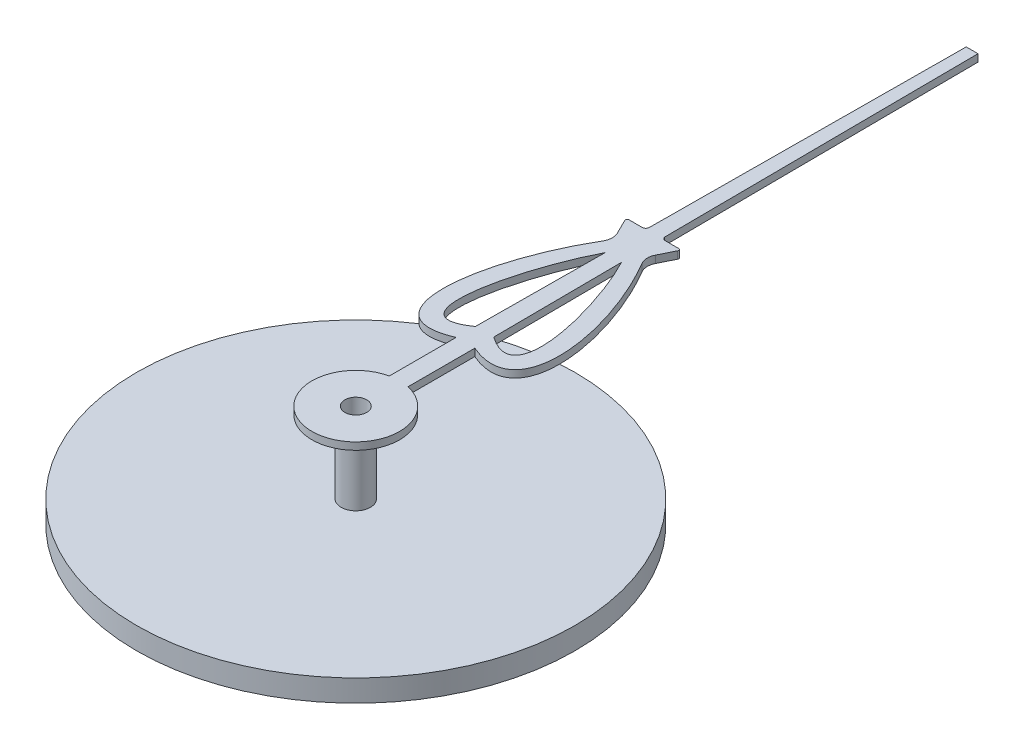
ISO-10303-21;
HEADER;
FILE_DESCRIPTION(('STEP AP214'),'2;1');
FILE_NAME('part.step','',(''),(''),'','','');
FILE_SCHEMA(('AUTOMOTIVE_DESIGN { 1 0 10303 214 1 1 1 1 }'));
ENDSEC;
DATA;
#1=APPLICATION_CONTEXT('core data for automotive mechanical design processes');
#2=APPLICATION_PROTOCOL_DEFINITION('international standard','automotive_design',2000,#1);
#3=PRODUCT_CONTEXT('',#1,'mechanical');
#4=PRODUCT('Part','Part','',(#3));
#5=PRODUCT_RELATED_PRODUCT_CATEGORY('part','',(#4));
#6=PRODUCT_DEFINITION_FORMATION('','',#4);
#7=PRODUCT_DEFINITION_CONTEXT('part definition',#1,'design');
#8=PRODUCT_DEFINITION('design','',#6,#7);
#9=PRODUCT_DEFINITION_SHAPE('','',#8);
#10=(LENGTH_UNIT() NAMED_UNIT(*) SI_UNIT(.MILLI.,.METRE.));
#11=(NAMED_UNIT(*) PLANE_ANGLE_UNIT() SI_UNIT($,.RADIAN.));
#12=(NAMED_UNIT(*) SI_UNIT($,.STERADIAN.) SOLID_ANGLE_UNIT());
#13=UNCERTAINTY_MEASURE_WITH_UNIT(LENGTH_MEASURE(1.E-05),#10,'distance_accuracy_value','');
#14=(GEOMETRIC_REPRESENTATION_CONTEXT(3) GLOBAL_UNCERTAINTY_ASSIGNED_CONTEXT((#13)) GLOBAL_UNIT_ASSIGNED_CONTEXT((#10,
#11,#12)) REPRESENTATION_CONTEXT('',''));
#15=CARTESIAN_POINT('',(0.,0.,0.));
#16=DIRECTION('',(0.,0.,1.));
#17=DIRECTION('',(1.,0.,0.));
#18=AXIS2_PLACEMENT_3D('',#15,#16,#17);
#19=CARTESIAN_POINT('',(-0.439252371956547,0.,-3.75029242968909));
#20=DIRECTION('',(0.,-1.,0.));
#21=DIRECTION('',(0.,0.,-1.));
#22=AXIS2_PLACEMENT_3D('',#19,#20,#21);
#23=PLANE('',#22);
#24=DIRECTION('',(0.00676100184731207,0.,0.999977144165816));
#25=VECTOR('',#24,1.);
#26=CARTESIAN_POINT('',(0.113918238942897,0.,-3.52247358415932));
#27=LINE('',#26,#25);
#28=CARTESIAN_POINT('',(0.113918238942897,0.,-3.52247358415932));
#29=VERTEX_POINT('',#28);
#30=CARTESIAN_POINT('',(0.125824318370261,0.,-1.76152046317765));
#31=VERTEX_POINT('',#30);
#32=EDGE_CURVE('E192',#29,#31,#27,.T.);
#33=ORIENTED_EDGE('',*,*,#32,.T.);
#34=CARTESIAN_POINT('',(0.125824318370261,0.,-1.76152046317765));
#35=CARTESIAN_POINT('',(0.890796604890787,0.,-1.23150101661974));
#36=CARTESIAN_POINT('',(0.501435582065783,0.,-2.78570546726484));
#37=CARTESIAN_POINT('',(0.113918238942897,0.,-3.52247358415932));
#38=B_SPLINE_CURVE_WITH_KNOTS('',3,(#34,#35,#36,#37),.UNSPECIFIED.,.F.,.F.,(4,4),
(0.0442298072719746,0.913901264469288),.UNSPECIFIED.);
#39=EDGE_CURVE('E55',#31,#29,#38,.T.);
#40=ORIENTED_EDGE('',*,*,#39,.T.);
#41=EDGE_LOOP('',(#33,#40));
#42=FACE_BOUND('',#41,.T.);
#43=CARTESIAN_POINT('',(-0.439252371956547,0.,-3.75029242968909));
#44=DIRECTION('',(0.,-1.,0.));
#45=DIRECTION('',(0.,0.,-1.));
#46=AXIS2_PLACEMENT_3D('',#43,#44,#45);
#47=CIRCLE('',#46,0.2);
#48=CARTESIAN_POINT('',(-0.260097073319557,0.,-3.83919338002311));
#49=VERTEX_POINT('',#48);
#50=CARTESIAN_POINT('',(-0.267201121331266,0.,-3.64832004539669));
#51=VERTEX_POINT('',#50);
#52=EDGE_CURVE('E250',#49,#51,#47,.T.);
#53=ORIENTED_EDGE('',*,*,#52,.F.);
#54=DIRECTION('',(0.444504751670083,0.,0.895776493184945));
#55=VECTOR('',#54,1.);
#56=CARTESIAN_POINT('',(-0.359543257675398,0.,-4.03959968377623));
#57=LINE('',#56,#55);
#58=CARTESIAN_POINT('',(-0.359543257675398,0.,-4.03959968377623));
#59=VERTEX_POINT('',#58);
#60=EDGE_CURVE('E255',#59,#49,#57,.T.);
#61=ORIENTED_EDGE('',*,*,#60,.F.);
#62=CARTESIAN_POINT('',(-0.341513018869607,0.,-4.05430167591648));
#63=DIRECTION('',(0.,1.,0.));
#64=DIRECTION('',(0.,0.,1.));
#65=AXIS2_PLACEMENT_3D('',#62,#63,#64);
#66=CIRCLE('',#65,0.0232645241577366);
#67=CARTESIAN_POINT('',(-0.338780115051659,0.,-4.07740512416577));
#68=VERTEX_POINT('',#67);
#69=EDGE_CURVE('E365',#68,#59,#66,.T.);
#70=ORIENTED_EDGE('',*,*,#69,.F.);
#71=DIRECTION('',(-1.,0.,0.));
#72=VECTOR('',#71,1.);
#73=CARTESIAN_POINT('',(-0.338780115051659,0.,-4.07740512416577));
#74=LINE('',#73,#72);
#75=CARTESIAN_POINT('',(-0.15739830831444,0.,-4.07740512416578));
#76=VERTEX_POINT('',#75);
#77=EDGE_CURVE('E363',#76,#68,#74,.T.);
#78=ORIENTED_EDGE('',*,*,#77,.F.);
#79=CARTESIAN_POINT('',(-0.157920702518011,0.,-4.1265883765196));
#80=DIRECTION('',(0.,-1.,0.));
#81=DIRECTION('',(0.,0.,1.));
#82=AXIS2_PLACEMENT_3D('',#79,#80,#81);
#83=CIRCLE('',#82,0.0491860265502689);
#84=CARTESIAN_POINT('',(-0.108734748762399,0.,-4.12667299894273));
#85=VERTEX_POINT('',#84);
#86=EDGE_CURVE('E361',#85,#76,#83,.T.);
#87=ORIENTED_EDGE('',*,*,#86,.F.);
#88=DIRECTION('',(-0.00654590531321647,0.,0.999978575332307));
#89=VECTOR('',#88,1.);
#90=CARTESIAN_POINT('',(-0.108734748762399,0.,-4.12667299894273));
#91=LINE('',#90,#89);
#92=CARTESIAN_POINT('',(-0.0805415314806858,0.,-8.43358119611438));
#93=VERTEX_POINT('',#92);
#94=EDGE_CURVE('E359',#93,#85,#91,.T.);
#95=ORIENTED_EDGE('',*,*,#94,.F.);
#96=DIRECTION('',(-1.,0.,0.));
#97=VECTOR('',#96,1.);
#98=CARTESIAN_POINT('',(-0.0805415314806858,0.,-8.43358119611438));
#99=LINE('',#98,#97);
#100=CARTESIAN_POINT('',(0.0806992721334232,0.,-8.43358119611438));
#101=VERTEX_POINT('',#100);
#102=EDGE_CURVE('E357',#101,#93,#99,.T.);
#103=ORIENTED_EDGE('',*,*,#102,.F.);
#104=DIRECTION('',(-0.00676429048693853,0.,-0.999977121925401));
#105=VECTOR('',#104,1.);
#106=CARTESIAN_POINT('',(0.109905863169236,0.,-4.11591877436605));
#107=LINE('',#106,#105);
#108=CARTESIAN_POINT('',(0.109905863169236,0.,-4.11591877436605));
#109=VERTEX_POINT('',#108);
#110=EDGE_CURVE('E355',#109,#101,#107,.T.);
#111=ORIENTED_EDGE('',*,*,#110,.F.);
#112=CARTESIAN_POINT('',(0.157920702518011,0.,-4.1265883765196));
#113=DIRECTION('',(0.,-1.,0.));
#114=DIRECTION('',(0.,0.,-1.));
#115=AXIS2_PLACEMENT_3D('',#112,#113,#114);
#116=CIRCLE('',#115,0.0491860265502685);
#117=CARTESIAN_POINT('',(0.15739830831444,0.,-4.07740512416578));
#118=VERTEX_POINT('',#117);
#119=EDGE_CURVE('E353',#118,#109,#116,.T.);
#120=ORIENTED_EDGE('',*,*,#119,.F.);
#121=DIRECTION('',(-1.,0.,0.));
#122=VECTOR('',#121,1.);
#123=CARTESIAN_POINT('',(0.338780115051659,0.,-4.07740512416577));
#124=LINE('',#123,#122);
#125=CARTESIAN_POINT('',(0.338780115051659,0.,-4.07740512416577));
#126=VERTEX_POINT('',#125);
#127=EDGE_CURVE('E351',#126,#118,#124,.T.);
#128=ORIENTED_EDGE('',*,*,#127,.F.);
#129=CARTESIAN_POINT('',(0.341513018869607,0.,-4.05430167591648));
#130=DIRECTION('',(0.,1.,0.));
#131=DIRECTION('',(0.,0.,-1.));
#132=AXIS2_PLACEMENT_3D('',#129,#130,#131);
#133=CIRCLE('',#132,0.0232645241577355);
#134=CARTESIAN_POINT('',(0.359543257675399,0.,-4.03959968377623));
#135=VERTEX_POINT('',#134);
#136=EDGE_CURVE('E349',#135,#126,#133,.T.);
#137=ORIENTED_EDGE('',*,*,#136,.F.);
#138=DIRECTION('',(0.444504751670083,0.,-0.895776493184945));
#139=VECTOR('',#138,1.);
#140=CARTESIAN_POINT('',(0.359543257675398,0.,-4.03959968377623));
#141=LINE('',#140,#139);
#142=CARTESIAN_POINT('',(0.260097073319557,0.,-3.83919338002311));
#143=VERTEX_POINT('',#142);
#144=EDGE_CURVE('E347',#143,#135,#141,.T.);
#145=ORIENTED_EDGE('',*,*,#144,.F.);
#146=CARTESIAN_POINT('',(0.439252371956547,0.,-3.7502924296891));
#147=DIRECTION('',(0.,-1.,0.));
#148=DIRECTION('',(0.,0.,1.));
#149=AXIS2_PLACEMENT_3D('',#146,#147,#148);
#150=CIRCLE('',#149,0.2);
#151=CARTESIAN_POINT('',(0.267201121331266,0.,-3.6483200453967));
#152=VERTEX_POINT('',#151);
#153=EDGE_CURVE('E342',#152,#143,#150,.T.);
#154=ORIENTED_EDGE('',*,*,#153,.F.);
#155=CARTESIAN_POINT('',(0.127585762607159,0.,-1.50099635485761));
#156=CARTESIAN_POINT('',(1.09963417027628,0.,-1.08449408649671));
#157=CARTESIAN_POINT('',(0.895222739099174,0.,-2.58870076213929));
#158=CARTESIAN_POINT('',(0.267201121331267,0.,-3.64832004539669));
#159=B_SPLINE_CURVE_WITH_KNOTS('',3,(#155,#156,#157,#158),.UNSPECIFIED.,.F.,.F.,(4,4),(0.,
0.927047388848107),.UNSPECIFIED.);
#160=CARTESIAN_POINT('',(0.127585762607159,0.,-1.50099635485761));
#161=VERTEX_POINT('',#160);
#162=EDGE_CURVE('E338',#161,#152,#159,.T.);
#163=ORIENTED_EDGE('',*,*,#162,.F.);
#164=DIRECTION('',(0.,0.,-1.));
#165=VECTOR('',#164,1.);
#166=CARTESIAN_POINT('',(0.127585762607159,0.,-0.586277982854507));
#167=LINE('',#166,#165);
#168=CARTESIAN_POINT('',(0.127585762607159,0.,-0.586277982854507));
#169=VERTEX_POINT('',#168);
#170=EDGE_CURVE('E336',#169,#161,#167,.T.);
#171=ORIENTED_EDGE('',*,*,#170,.F.);
#172=CARTESIAN_POINT('',(0.,0.,0.));
#173=DIRECTION('',(0.,1.,0.));
#174=DIRECTION('',(0.,0.,1.));
#175=AXIS2_PLACEMENT_3D('',#172,#173,#174);
#176=CIRCLE('',#175,0.6);
#177=CARTESIAN_POINT('',(-0.127585762607159,0.,-0.586277982854507));
#178=VERTEX_POINT('',#177);
#179=EDGE_CURVE('E334',#178,#169,#176,.T.);
#180=ORIENTED_EDGE('',*,*,#179,.F.);
#181=DIRECTION('',(0.,0.,1.));
#182=VECTOR('',#181,1.);
#183=CARTESIAN_POINT('',(-0.127585762607159,0.,-0.586277982854507));
#184=LINE('',#183,#182);
#185=CARTESIAN_POINT('',(-0.127585762607159,0.,-1.50099635485761));
#186=VERTEX_POINT('',#185);
#187=EDGE_CURVE('E329',#186,#178,#184,.T.);
#188=ORIENTED_EDGE('',*,*,#187,.F.);
#189=CARTESIAN_POINT('',(-0.267201121331266,0.,-3.64832004539669));
#190=CARTESIAN_POINT('',(-0.581211930214034,0.,-3.11851040376647));
#191=CARTESIAN_POINT('',(-0.9974284546826,0.,-1.83659742433071));
#192=CARTESIAN_POINT('',(-0.613609966442191,0.,-1.29274522067696));
#193=CARTESIAN_POINT('',(-0.127585762607159,0.,-1.50099635485761));
#194=B_SPLINE_CURVE_WITH_KNOTS('',3,(#189,#190,#191,#192,#193),.UNSPECIFIED.,.F.,.F.,(4,1,4),
(0.,0.463523694424504,0.927047388849008),.UNSPECIFIED.);
#195=EDGE_CURVE('E325',#51,#186,#194,.T.);
#196=ORIENTED_EDGE('',*,*,#195,.F.);
#197=EDGE_LOOP('',(#53,#61,#70,#78,#87,#95,#103,#111,#120,#128,#137,#145,#154,#163,#171,#180,
#188,#196));
#198=FACE_BOUND('',#197,.T.);
#199=DIRECTION('',(0.00717930293046789,0.,-0.999974228472631));
#200=VECTOR('',#199,1.);
#201=CARTESIAN_POINT('',(-0.113060898003382,0.,-3.52410227704847));
#202=LINE('',#201,#200);
#203=CARTESIAN_POINT('',(-0.125714787999534,0.,-1.76159636127489));
#204=VERTEX_POINT('',#203);
#205=CARTESIAN_POINT('',(-0.113060898003382,0.,-3.52410227704847));
#206=VERTEX_POINT('',#205);
#207=EDGE_CURVE('E229',#204,#206,#202,.T.);
#208=ORIENTED_EDGE('',*,*,#207,.T.);
#209=CARTESIAN_POINT('',(-0.113060898003382,0.,-3.52410227704847));
#210=CARTESIAN_POINT('',(-0.500879165719079,0.,-2.78796384765671));
#211=CARTESIAN_POINT('',(-0.891397992087325,0.,-1.23096165036123));
#212=CARTESIAN_POINT('',(-0.125714787999534,0.,-1.76159636127489));
#213=B_SPLINE_CURVE_WITH_KNOTS('',3,(#209,#210,#211,#212),.UNSPECIFIED.,.F.,.F.,(4,4),
(0.0441883031194786,0.914542618958986),.UNSPECIFIED.);
#214=EDGE_CURVE('E235',#206,#204,#213,.T.);
#215=ORIENTED_EDGE('',*,*,#214,.T.);
#216=EDGE_LOOP('',(#208,#215));
#217=FACE_BOUND('',#216,.T.);
#218=CARTESIAN_POINT('',(0.,0.,0.));
#219=DIRECTION('',(0.,-1.,0.));
#220=DIRECTION('',(0.,0.,-1.));
#221=AXIS2_PLACEMENT_3D('',#218,#219,#220);
#222=CIRCLE('',#221,0.2);
#223=CARTESIAN_POINT('',(0.,0.,-0.2));
#224=VERTEX_POINT('',#223);
#225=EDGE_CURVE('E199',#224,#224,#222,.T.);
#226=ORIENTED_EDGE('',*,*,#225,.F.);
#227=EDGE_LOOP('',(#226));
#228=FACE_BOUND('',#227,.T.);
#229=ADVANCED_FACE('F33',(#42,#198,#217,#228),#23,.T.);
#230=CARTESIAN_POINT('',(-0.439252371956547,0.1,-3.75029242968909));
#231=DIRECTION('',(0.,-1.,0.));
#232=DIRECTION('',(0.,0.,-1.));
#233=AXIS2_PLACEMENT_3D('',#230,#231,#232);
#234=PLANE('',#233);
#235=CARTESIAN_POINT('',(0.,0.1,0.));
#236=DIRECTION('',(0.,1.,0.));
#237=DIRECTION('',(0.,0.,1.));
#238=AXIS2_PLACEMENT_3D('',#235,#236,#237);
#239=CIRCLE('',#238,0.15);
#240=CARTESIAN_POINT('',(0.,0.1,0.15));
#241=VERTEX_POINT('',#240);
#242=EDGE_CURVE('E721',#241,#241,#239,.T.);
#243=ORIENTED_EDGE('',*,*,#242,.F.);
#244=EDGE_LOOP('',(#243));
#245=FACE_BOUND('',#244,.T.);
#246=CARTESIAN_POINT('',(-0.113060898003382,0.1,-3.52410227704847));
#247=CARTESIAN_POINT('',(-0.500879165719079,0.1,-2.78796384765671));
#248=CARTESIAN_POINT('',(-0.891397992087325,0.1,-1.23096165036123));
#249=CARTESIAN_POINT('',(-0.125714787999534,0.1,-1.76159636127489));
#250=B_SPLINE_CURVE_WITH_KNOTS('',3,(#246,#247,#248,#249),.UNSPECIFIED.,.F.,.F.,(4,4),
(0.0441883031194786,0.914542618958986),.UNSPECIFIED.);
#251=CARTESIAN_POINT('',(-0.113060898003382,0.1,-3.52410227704847));
#252=VERTEX_POINT('',#251);
#253=CARTESIAN_POINT('',(-0.125714787999534,0.1,-1.76159636127489));
#254=VERTEX_POINT('',#253);
#255=EDGE_CURVE('E221',#252,#254,#250,.T.);
#256=ORIENTED_EDGE('',*,*,#255,.F.);
#257=DIRECTION('',(0.00717930293046789,0.,-0.999974228472631));
#258=VECTOR('',#257,1.);
#259=CARTESIAN_POINT('',(-0.113060898003382,0.1,-3.52410227704847));
#260=LINE('',#259,#258);
#261=EDGE_CURVE('E228',#254,#252,#260,.T.);
#262=ORIENTED_EDGE('',*,*,#261,.F.);
#263=EDGE_LOOP('',(#256,#262));
#264=FACE_BOUND('',#263,.T.);
#265=CARTESIAN_POINT('',(-0.439252371956547,0.1,-3.75029242968909));
#266=DIRECTION('',(0.,-1.,0.));
#267=DIRECTION('',(0.,0.,-1.));
#268=AXIS2_PLACEMENT_3D('',#265,#266,#267);
#269=CIRCLE('',#268,0.2);
#270=CARTESIAN_POINT('',(-0.260097073319557,0.1,-3.83919338002311));
#271=VERTEX_POINT('',#270);
#272=CARTESIAN_POINT('',(-0.267201121331266,0.1,-3.64832004539669));
#273=VERTEX_POINT('',#272);
#274=EDGE_CURVE('E251',#271,#273,#269,.T.);
#275=ORIENTED_EDGE('',*,*,#274,.T.);
#276=CARTESIAN_POINT('',(-0.267201121331266,0.1,-3.64832004539669));
#277=CARTESIAN_POINT('',(-0.581211930214034,0.1,-3.11851040376647));
#278=CARTESIAN_POINT('',(-0.9974284546826,0.1,-1.83659742433071));
#279=CARTESIAN_POINT('',(-0.613609966442191,0.1,-1.29274522067696));
#280=CARTESIAN_POINT('',(-0.127585762607159,0.1,-1.50099635485761));
#281=B_SPLINE_CURVE_WITH_KNOTS('',3,(#276,#277,#278,#279,#280),.UNSPECIFIED.,.F.,.F.,(4,1,4),
(0.,0.463523694424504,0.927047388849008),.UNSPECIFIED.);
#282=CARTESIAN_POINT('',(-0.127585762607159,0.1,-1.50099635485761));
#283=VERTEX_POINT('',#282);
#284=EDGE_CURVE('E254',#273,#283,#281,.T.);
#285=ORIENTED_EDGE('',*,*,#284,.T.);
#286=DIRECTION('',(0.,0.,1.));
#287=VECTOR('',#286,1.);
#288=CARTESIAN_POINT('',(-0.127585762607159,0.1,-0.586277982854507));
#289=LINE('',#288,#287);
#290=CARTESIAN_POINT('',(-0.127585762607159,0.1,-0.586277982854507));
#291=VERTEX_POINT('',#290);
#292=EDGE_CURVE('E260',#283,#291,#289,.T.);
#293=ORIENTED_EDGE('',*,*,#292,.T.);
#294=CARTESIAN_POINT('',(0.,0.1,0.));
#295=DIRECTION('',(0.,1.,0.));
#296=DIRECTION('',(0.,0.,1.));
#297=AXIS2_PLACEMENT_3D('',#294,#295,#296);
#298=CIRCLE('',#297,0.6);
#299=CARTESIAN_POINT('',(0.127585762607159,0.1,-0.586277982854507));
#300=VERTEX_POINT('',#299);
#301=EDGE_CURVE('E431',#291,#300,#298,.T.);
#302=ORIENTED_EDGE('',*,*,#301,.T.);
#303=DIRECTION('',(0.,0.,-1.));
#304=VECTOR('',#303,1.);
#305=CARTESIAN_POINT('',(0.127585762607159,0.1,-0.586277982854507));
#306=LINE('',#305,#304);
#307=CARTESIAN_POINT('',(0.127585762607159,0.1,-1.50099635485761));
#308=VERTEX_POINT('',#307);
#309=EDGE_CURVE('E295',#300,#308,#306,.T.);
#310=ORIENTED_EDGE('',*,*,#309,.T.);
#311=CARTESIAN_POINT('',(0.127585762607159,0.1,-1.50099635485761));
#312=CARTESIAN_POINT('',(1.09963417027628,0.1,-1.08449408649671));
#313=CARTESIAN_POINT('',(0.895222739099174,0.1,-2.58870076213929));
#314=CARTESIAN_POINT('',(0.267201121331267,0.1,-3.64832004539669));
#315=B_SPLINE_CURVE_WITH_KNOTS('',3,(#311,#312,#313,#314),.UNSPECIFIED.,.F.,.F.,(4,4),(0.,
0.927047388848107),.UNSPECIFIED.);
#316=CARTESIAN_POINT('',(0.267201121331266,0.1,-3.6483200453967));
#317=VERTEX_POINT('',#316);
#318=EDGE_CURVE('E288',#308,#317,#315,.T.);
#319=ORIENTED_EDGE('',*,*,#318,.T.);
#320=CARTESIAN_POINT('',(0.439252371956547,0.1,-3.7502924296891));
#321=DIRECTION('',(0.,-1.,0.));
#322=DIRECTION('',(0.,0.,1.));
#323=AXIS2_PLACEMENT_3D('',#320,#321,#322);
#324=CIRCLE('',#323,0.2);
#325=CARTESIAN_POINT('',(0.260097073319557,0.1,-3.83919338002311));
#326=VERTEX_POINT('',#325);
#327=EDGE_CURVE('E294',#317,#326,#324,.T.);
#328=ORIENTED_EDGE('',*,*,#327,.T.);
#329=DIRECTION('',(0.444504751670083,0.,-0.895776493184945));
#330=VECTOR('',#329,1.);
#331=CARTESIAN_POINT('',(0.359543257675398,0.1,-4.03959968377623));
#332=LINE('',#331,#330);
#333=CARTESIAN_POINT('',(0.359543257675399,0.1,-4.03959968377623));
#334=VERTEX_POINT('',#333);
#335=EDGE_CURVE('E300',#326,#334,#332,.T.);
#336=ORIENTED_EDGE('',*,*,#335,.T.);
#337=CARTESIAN_POINT('',(0.341513018869607,0.1,-4.05430167591648));
#338=DIRECTION('',(0.,1.,0.));
#339=DIRECTION('',(0.,0.,-1.));
#340=AXIS2_PLACEMENT_3D('',#337,#338,#339);
#341=CIRCLE('',#340,0.0232645241577355);
#342=CARTESIAN_POINT('',(0.338780115051659,0.1,-4.07740512416577));
#343=VERTEX_POINT('',#342);
#344=EDGE_CURVE('E302',#334,#343,#341,.T.);
#345=ORIENTED_EDGE('',*,*,#344,.T.);
#346=DIRECTION('',(-1.,0.,0.));
#347=VECTOR('',#346,1.);
#348=CARTESIAN_POINT('',(0.338780115051659,0.1,-4.07740512416577));
#349=LINE('',#348,#347);
#350=CARTESIAN_POINT('',(0.15739830831444,0.1,-4.07740512416578));
#351=VERTEX_POINT('',#350);
#352=EDGE_CURVE('E304',#343,#351,#349,.T.);
#353=ORIENTED_EDGE('',*,*,#352,.T.);
#354=CARTESIAN_POINT('',(0.157920702518011,0.1,-4.1265883765196));
#355=DIRECTION('',(0.,-1.,0.));
#356=DIRECTION('',(0.,0.,-1.));
#357=AXIS2_PLACEMENT_3D('',#354,#355,#356);
#358=CIRCLE('',#357,0.0491860265502685);
#359=CARTESIAN_POINT('',(0.109905863169236,0.1,-4.11591877436605));
#360=VERTEX_POINT('',#359);
#361=EDGE_CURVE('E306',#351,#360,#358,.T.);
#362=ORIENTED_EDGE('',*,*,#361,.T.);
#363=DIRECTION('',(-0.00676429048693853,0.,-0.999977121925401));
#364=VECTOR('',#363,1.);
#365=CARTESIAN_POINT('',(0.109905863169236,0.1,-4.11591877436605));
#366=LINE('',#365,#364);
#367=CARTESIAN_POINT('',(0.0806992721334232,0.1,-8.43358119611438));
#368=VERTEX_POINT('',#367);
#369=EDGE_CURVE('E308',#360,#368,#366,.T.);
#370=ORIENTED_EDGE('',*,*,#369,.T.);
#371=DIRECTION('',(-1.,0.,0.));
#372=VECTOR('',#371,1.);
#373=CARTESIAN_POINT('',(-0.0805415314806858,0.1,-8.43358119611438));
#374=LINE('',#373,#372);
#375=CARTESIAN_POINT('',(-0.0805415314806858,0.1,-8.43358119611438));
#376=VERTEX_POINT('',#375);
#377=EDGE_CURVE('E310',#368,#376,#374,.T.);
#378=ORIENTED_EDGE('',*,*,#377,.T.);
#379=DIRECTION('',(-0.00654590531321647,0.,0.999978575332307));
#380=VECTOR('',#379,1.);
#381=CARTESIAN_POINT('',(-0.108734748762399,0.1,-4.12667299894273));
#382=LINE('',#381,#380);
#383=CARTESIAN_POINT('',(-0.108734748762399,0.1,-4.12667299894273));
#384=VERTEX_POINT('',#383);
#385=EDGE_CURVE('E312',#376,#384,#382,.T.);
#386=ORIENTED_EDGE('',*,*,#385,.T.);
#387=CARTESIAN_POINT('',(-0.157920702518011,0.1,-4.1265883765196));
#388=DIRECTION('',(0.,-1.,0.));
#389=DIRECTION('',(0.,0.,1.));
#390=AXIS2_PLACEMENT_3D('',#387,#388,#389);
#391=CIRCLE('',#390,0.0491860265502689);
#392=CARTESIAN_POINT('',(-0.15739830831444,0.1,-4.07740512416578));
#393=VERTEX_POINT('',#392);
#394=EDGE_CURVE('E314',#384,#393,#391,.T.);
#395=ORIENTED_EDGE('',*,*,#394,.T.);
#396=DIRECTION('',(-1.,0.,0.));
#397=VECTOR('',#396,1.);
#398=CARTESIAN_POINT('',(-0.338780115051659,0.1,-4.07740512416577));
#399=LINE('',#398,#397);
#400=CARTESIAN_POINT('',(-0.338780115051659,0.1,-4.07740512416577));
#401=VERTEX_POINT('',#400);
#402=EDGE_CURVE('E316',#393,#401,#399,.T.);
#403=ORIENTED_EDGE('',*,*,#402,.T.);
#404=CARTESIAN_POINT('',(-0.341513018869607,0.1,-4.05430167591648));
#405=DIRECTION('',(0.,1.,0.));
#406=DIRECTION('',(0.,0.,1.));
#407=AXIS2_PLACEMENT_3D('',#404,#405,#406);
#408=CIRCLE('',#407,0.0232645241577366);
#409=CARTESIAN_POINT('',(-0.359543257675398,0.1,-4.03959968377623));
#410=VERTEX_POINT('',#409);
#411=EDGE_CURVE('E318',#401,#410,#408,.T.);
#412=ORIENTED_EDGE('',*,*,#411,.T.);
#413=DIRECTION('',(0.444504751670083,0.,0.895776493184945));
#414=VECTOR('',#413,1.);
#415=CARTESIAN_POINT('',(-0.359543257675398,0.1,-4.03959968377623));
#416=LINE('',#415,#414);
#417=EDGE_CURVE('E320',#410,#271,#416,.T.);
#418=ORIENTED_EDGE('',*,*,#417,.T.);
#419=EDGE_LOOP('',(#275,#285,#293,#302,#310,#319,#328,#336,#345,#353,#362,#370,#378,#386,#395,
#403,#412,#418));
#420=FACE_BOUND('',#419,.T.);
#421=CARTESIAN_POINT('',(0.125824318370261,0.1,-1.76152046317765));
#422=CARTESIAN_POINT('',(0.890796604890787,0.1,-1.23150101661974));
#423=CARTESIAN_POINT('',(0.501435582065783,0.1,-2.78570546726484));
#424=CARTESIAN_POINT('',(0.113918238942897,0.1,-3.52247358415932));
#425=B_SPLINE_CURVE_WITH_KNOTS('',3,(#421,#422,#423,#424),.UNSPECIFIED.,.F.,.F.,(4,4),
(0.0442298072719746,0.913901264469288),.UNSPECIFIED.);
#426=CARTESIAN_POINT('',(0.125824318370261,0.1,-1.76152046317765));
#427=VERTEX_POINT('',#426);
#428=CARTESIAN_POINT('',(0.113918238942897,0.1,-3.52247358415932));
#429=VERTEX_POINT('',#428);
#430=EDGE_CURVE('E187',#427,#429,#425,.T.);
#431=ORIENTED_EDGE('',*,*,#430,.F.);
#432=DIRECTION('',(0.00676100184731207,0.,0.999977144165816));
#433=VECTOR('',#432,1.);
#434=CARTESIAN_POINT('',(0.113918238942897,0.1,-3.52247358415932));
#435=LINE('',#434,#433);
#436=EDGE_CURVE('E181',#429,#427,#435,.T.);
#437=ORIENTED_EDGE('',*,*,#436,.F.);
#438=EDGE_LOOP('',(#431,#437));
#439=FACE_BOUND('',#438,.T.);
#440=ADVANCED_FACE('F191',(#245,#264,#420,#439),#234,.F.);
#441=CARTESIAN_POINT('',(-0.439252371956547,0.1,-3.75029242968909));
#442=DIRECTION('',(0.,-1.,0.));
#443=DIRECTION('',(0.,0.,-1.));
#444=AXIS2_PLACEMENT_3D('',#441,#442,#443);
#445=CYLINDRICAL_SURFACE('',#444,0.2);
#446=ORIENTED_EDGE('',*,*,#52,.T.);
#447=DIRECTION('',(0.,-1.,0.));
#448=VECTOR('',#447,1.);
#449=CARTESIAN_POINT('',(-0.267201121331266,0.1,-3.64832004539669));
#450=LINE('',#449,#448);
#451=EDGE_CURVE('E11',#273,#51,#450,.T.);
#452=ORIENTED_EDGE('',*,*,#451,.F.);
#453=ORIENTED_EDGE('',*,*,#274,.F.);
#454=DIRECTION('',(0.,-1.,0.));
#455=VECTOR('',#454,1.);
#456=CARTESIAN_POINT('',(-0.260097073319557,0.1,-3.83919338002311));
#457=LINE('',#456,#455);
#458=EDGE_CURVE('E322',#271,#49,#457,.T.);
#459=ORIENTED_EDGE('',*,*,#458,.T.);
#460=EDGE_LOOP('',(#446,#452,#453,#459));
#461=FACE_BOUND('',#460,.T.);
#462=ADVANCED_FACE('F35',(#461),#445,.F.);
#463=DIRECTION('',(0.,-1.,0.));
#464=VECTOR('',#463,1.);
#465=SURFACE_OF_LINEAR_EXTRUSION('',#281,#464);
#466=ORIENTED_EDGE('',*,*,#195,.T.);
#467=DIRECTION('',(0.,-1.,0.));
#468=VECTOR('',#467,1.);
#469=CARTESIAN_POINT('',(-0.127585762607159,0.1,-1.50099635485761));
#470=LINE('',#469,#468);
#471=EDGE_CURVE('E41',#283,#186,#470,.T.);
#472=ORIENTED_EDGE('',*,*,#471,.F.);
#473=ORIENTED_EDGE('',*,*,#284,.F.);
#474=ORIENTED_EDGE('',*,*,#451,.T.);
#475=EDGE_LOOP('',(#466,#472,#473,#474));
#476=FACE_BOUND('',#475,.T.);
#477=ADVANCED_FACE('F265',(#476),#465,.F.);
#478=CARTESIAN_POINT('',(-0.127585762607159,0.1,-0.586277982854507));
#479=DIRECTION('',(1.,0.,0.));
#480=DIRECTION('',(0.,0.,-1.));
#481=AXIS2_PLACEMENT_3D('',#478,#479,#480);
#482=PLANE('',#481);
#483=ORIENTED_EDGE('',*,*,#187,.T.);
#484=DIRECTION('',(0.,-1.,0.));
#485=VECTOR('',#484,1.);
#486=CARTESIAN_POINT('',(-0.127585762607159,0.1,-0.586277982854507));
#487=LINE('',#486,#485);
#488=EDGE_CURVE('E412',#291,#178,#487,.T.);
#489=ORIENTED_EDGE('',*,*,#488,.F.);
#490=ORIENTED_EDGE('',*,*,#292,.F.);
#491=ORIENTED_EDGE('',*,*,#471,.T.);
#492=EDGE_LOOP('',(#483,#489,#490,#491));
#493=FACE_BOUND('',#492,.T.);
#494=ADVANCED_FACE('F268',(#493),#482,.F.);
#495=CARTESIAN_POINT('',(0.,0.1,0.));
#496=DIRECTION('',(0.,-1.,0.));
#497=DIRECTION('',(0.,0.,-1.));
#498=AXIS2_PLACEMENT_3D('',#495,#496,#497);
#499=CYLINDRICAL_SURFACE('',#498,0.6);
#500=ORIENTED_EDGE('',*,*,#179,.T.);
#501=DIRECTION('',(0.,-1.,0.));
#502=VECTOR('',#501,1.);
#503=CARTESIAN_POINT('',(0.127585762607159,0.1,-0.586277982854507));
#504=LINE('',#503,#502);
#505=EDGE_CURVE('E409',#300,#169,#504,.T.);
#506=ORIENTED_EDGE('',*,*,#505,.F.);
#507=ORIENTED_EDGE('',*,*,#301,.F.);
#508=ORIENTED_EDGE('',*,*,#488,.T.);
#509=EDGE_LOOP('',(#500,#506,#507,#508));
#510=FACE_BOUND('',#509,.T.);
#511=ADVANCED_FACE('F272',(#510),#499,.T.);
#512=CARTESIAN_POINT('',(0.127585762607159,0.1,-0.586277982854507));
#513=DIRECTION('',(-1.,0.,0.));
#514=DIRECTION('',(0.,0.,1.));
#515=AXIS2_PLACEMENT_3D('',#512,#513,#514);
#516=PLANE('',#515);
#517=ORIENTED_EDGE('',*,*,#170,.T.);
#518=DIRECTION('',(0.,-1.,0.));
#519=VECTOR('',#518,1.);
#520=CARTESIAN_POINT('',(0.127585762607159,0.1,-1.50099635485761));
#521=LINE('',#520,#519);
#522=EDGE_CURVE('E406',#308,#161,#521,.T.);
#523=ORIENTED_EDGE('',*,*,#522,.F.);
#524=ORIENTED_EDGE('',*,*,#309,.F.);
#525=ORIENTED_EDGE('',*,*,#505,.T.);
#526=EDGE_LOOP('',(#517,#523,#524,#525));
#527=FACE_BOUND('',#526,.T.);
#528=ADVANCED_FACE('F276',(#527),#516,.F.);
#529=DIRECTION('',(0.,-1.,0.));
#530=VECTOR('',#529,1.);
#531=SURFACE_OF_LINEAR_EXTRUSION('',#315,#530);
#532=ORIENTED_EDGE('',*,*,#162,.T.);
#533=DIRECTION('',(0.,-1.,0.));
#534=VECTOR('',#533,1.);
#535=CARTESIAN_POINT('',(0.267201121331266,0.1,-3.6483200453967));
#536=LINE('',#535,#534);
#537=EDGE_CURVE('E403',#317,#152,#536,.T.);
#538=ORIENTED_EDGE('',*,*,#537,.F.);
#539=ORIENTED_EDGE('',*,*,#318,.F.);
#540=ORIENTED_EDGE('',*,*,#522,.T.);
#541=EDGE_LOOP('',(#532,#538,#539,#540));
#542=FACE_BOUND('',#541,.T.);
#543=ADVANCED_FACE('F280',(#542),#531,.F.);
#544=CARTESIAN_POINT('',(0.439252371956547,0.1,-3.7502924296891));
#545=DIRECTION('',(0.,-1.,0.));
#546=DIRECTION('',(0.,0.,-1.));
#547=AXIS2_PLACEMENT_3D('',#544,#545,#546);
#548=CYLINDRICAL_SURFACE('',#547,0.2);
#549=ORIENTED_EDGE('',*,*,#153,.T.);
#550=DIRECTION('',(0.,-1.,0.));
#551=VECTOR('',#550,1.);
#552=CARTESIAN_POINT('',(0.260097073319557,0.1,-3.83919338002311));
#553=LINE('',#552,#551);
#554=EDGE_CURVE('E400',#326,#143,#553,.T.);
#555=ORIENTED_EDGE('',*,*,#554,.F.);
#556=ORIENTED_EDGE('',*,*,#327,.F.);
#557=ORIENTED_EDGE('',*,*,#537,.T.);
#558=EDGE_LOOP('',(#549,#555,#556,#557));
#559=FACE_BOUND('',#558,.T.);
#560=ADVANCED_FACE('F285',(#559),#548,.F.);
#561=CARTESIAN_POINT('',(0.359543257675398,0.1,-4.03959968377623));
#562=DIRECTION('',(-0.895776493184945,0.,-0.444504751670083));
#563=DIRECTION('',(-0.444504751670083,0.,0.895776493184945));
#564=AXIS2_PLACEMENT_3D('',#561,#562,#563);
#565=PLANE('',#564);
#566=ORIENTED_EDGE('',*,*,#144,.T.);
#567=DIRECTION('',(0.,-1.,0.));
#568=VECTOR('',#567,1.);
#569=CARTESIAN_POINT('',(0.359543257675399,0.1,-4.03959968377623));
#570=LINE('',#569,#568);
#571=EDGE_CURVE('E397',#334,#135,#570,.T.);
#572=ORIENTED_EDGE('',*,*,#571,.F.);
#573=ORIENTED_EDGE('',*,*,#335,.F.);
#574=ORIENTED_EDGE('',*,*,#554,.T.);
#575=EDGE_LOOP('',(#566,#572,#573,#574));
#576=FACE_BOUND('',#575,.T.);
#577=ADVANCED_FACE('F489',(#576),#565,.F.);
#578=CARTESIAN_POINT('',(0.341513018869607,0.1,-4.05430167591648));
#579=DIRECTION('',(0.,-1.,0.));
#580=DIRECTION('',(0.,0.,-1.));
#581=AXIS2_PLACEMENT_3D('',#578,#579,#580);
#582=CYLINDRICAL_SURFACE('',#581,0.0232645241577355);
#583=ORIENTED_EDGE('',*,*,#136,.T.);
#584=DIRECTION('',(0.,-1.,0.));
#585=VECTOR('',#584,1.);
#586=CARTESIAN_POINT('',(0.338780115051659,0.1,-4.07740512416577));
#587=LINE('',#586,#585);
#588=EDGE_CURVE('E394',#343,#126,#587,.T.);
#589=ORIENTED_EDGE('',*,*,#588,.F.);
#590=ORIENTED_EDGE('',*,*,#344,.F.);
#591=ORIENTED_EDGE('',*,*,#571,.T.);
#592=EDGE_LOOP('',(#583,#589,#590,#591));
#593=FACE_BOUND('',#592,.T.);
#594=ADVANCED_FACE('F484',(#593),#582,.T.);
#595=CARTESIAN_POINT('',(0.338780115051659,0.1,-4.07740512416577));
#596=DIRECTION('',(0.,0.,1.));
#597=DIRECTION('',(1.,0.,0.));
#598=AXIS2_PLACEMENT_3D('',#595,#596,#597);
#599=PLANE('',#598);
#600=ORIENTED_EDGE('',*,*,#127,.T.);
#601=DIRECTION('',(0.,-1.,0.));
#602=VECTOR('',#601,1.);
#603=CARTESIAN_POINT('',(0.15739830831444,0.1,-4.07740512416578));
#604=LINE('',#603,#602);
#605=EDGE_CURVE('E391',#351,#118,#604,.T.);
#606=ORIENTED_EDGE('',*,*,#605,.F.);
#607=ORIENTED_EDGE('',*,*,#352,.F.);
#608=ORIENTED_EDGE('',*,*,#588,.T.);
#609=EDGE_LOOP('',(#600,#606,#607,#608));
#610=FACE_BOUND('',#609,.T.);
#611=ADVANCED_FACE('F478',(#610),#599,.F.);
#612=CARTESIAN_POINT('',(0.157920702518011,0.1,-4.1265883765196));
#613=DIRECTION('',(0.,-1.,0.));
#614=DIRECTION('',(0.,0.,-1.));
#615=AXIS2_PLACEMENT_3D('',#612,#613,#614);
#616=CYLINDRICAL_SURFACE('',#615,0.0491860265502685);
#617=ORIENTED_EDGE('',*,*,#119,.T.);
#618=DIRECTION('',(0.,-1.,0.));
#619=VECTOR('',#618,1.);
#620=CARTESIAN_POINT('',(0.109905863169236,0.1,-4.11591877436605));
#621=LINE('',#620,#619);
#622=EDGE_CURVE('E388',#360,#109,#621,.T.);
#623=ORIENTED_EDGE('',*,*,#622,.F.);
#624=ORIENTED_EDGE('',*,*,#361,.F.);
#625=ORIENTED_EDGE('',*,*,#605,.T.);
#626=EDGE_LOOP('',(#617,#623,#624,#625));
#627=FACE_BOUND('',#626,.T.);
#628=ADVANCED_FACE('F474',(#627),#616,.F.);
#629=CARTESIAN_POINT('',(0.109905863169236,0.1,-4.11591877436605));
#630=DIRECTION('',(-0.999977121925401,0.,0.00676429048693853));
#631=DIRECTION('',(0.00676429048693853,0.,0.999977121925401));
#632=AXIS2_PLACEMENT_3D('',#629,#630,#631);
#633=PLANE('',#632);
#634=ORIENTED_EDGE('',*,*,#110,.T.);
#635=DIRECTION('',(0.,-1.,0.));
#636=VECTOR('',#635,1.);
#637=CARTESIAN_POINT('',(0.0806992721334232,0.1,-8.43358119611438));
#638=LINE('',#637,#636);
#639=EDGE_CURVE('E385',#368,#101,#638,.T.);
#640=ORIENTED_EDGE('',*,*,#639,.F.);
#641=ORIENTED_EDGE('',*,*,#369,.F.);
#642=ORIENTED_EDGE('',*,*,#622,.T.);
#643=EDGE_LOOP('',(#634,#640,#641,#642));
#644=FACE_BOUND('',#643,.T.);
#645=ADVANCED_FACE('F469',(#644),#633,.F.);
#646=CARTESIAN_POINT('',(-0.0805415314806858,0.1,-8.43358119611438));
#647=DIRECTION('',(0.,0.,1.));
#648=DIRECTION('',(1.,0.,0.));
#649=AXIS2_PLACEMENT_3D('',#646,#647,#648);
#650=PLANE('',#649);
#651=ORIENTED_EDGE('',*,*,#102,.T.);
#652=DIRECTION('',(0.,-1.,0.));
#653=VECTOR('',#652,1.);
#654=CARTESIAN_POINT('',(-0.0805415314806858,0.1,-8.43358119611438));
#655=LINE('',#654,#653);
#656=EDGE_CURVE('E382',#376,#93,#655,.T.);
#657=ORIENTED_EDGE('',*,*,#656,.F.);
#658=ORIENTED_EDGE('',*,*,#377,.F.);
#659=ORIENTED_EDGE('',*,*,#639,.T.);
#660=EDGE_LOOP('',(#651,#657,#658,#659));
#661=FACE_BOUND('',#660,.T.);
#662=ADVANCED_FACE('F463',(#661),#650,.F.);
#663=CARTESIAN_POINT('',(-0.108734748762399,0.1,-4.12667299894273));
#664=DIRECTION('',(0.999978575332307,0.,0.00654590531321647));
#665=DIRECTION('',(0.00654590531321647,0.,-0.999978575332307));
#666=AXIS2_PLACEMENT_3D('',#663,#664,#665);
#667=PLANE('',#666);
#668=ORIENTED_EDGE('',*,*,#94,.T.);
#669=DIRECTION('',(0.,-1.,0.));
#670=VECTOR('',#669,1.);
#671=CARTESIAN_POINT('',(-0.108734748762399,0.1,-4.12667299894273));
#672=LINE('',#671,#670);
#673=EDGE_CURVE('E379',#384,#85,#672,.T.);
#674=ORIENTED_EDGE('',*,*,#673,.F.);
#675=ORIENTED_EDGE('',*,*,#385,.F.);
#676=ORIENTED_EDGE('',*,*,#656,.T.);
#677=EDGE_LOOP('',(#668,#674,#675,#676));
#678=FACE_BOUND('',#677,.T.);
#679=ADVANCED_FACE('F459',(#678),#667,.F.);
#680=CARTESIAN_POINT('',(-0.157920702518011,0.1,-4.1265883765196));
#681=DIRECTION('',(0.,-1.,0.));
#682=DIRECTION('',(0.,0.,-1.));
#683=AXIS2_PLACEMENT_3D('',#680,#681,#682);
#684=CYLINDRICAL_SURFACE('',#683,0.0491860265502689);
#685=ORIENTED_EDGE('',*,*,#86,.T.);
#686=DIRECTION('',(0.,-1.,0.));
#687=VECTOR('',#686,1.);
#688=CARTESIAN_POINT('',(-0.15739830831444,0.1,-4.07740512416578));
#689=LINE('',#688,#687);
#690=EDGE_CURVE('E376',#393,#76,#689,.T.);
#691=ORIENTED_EDGE('',*,*,#690,.F.);
#692=ORIENTED_EDGE('',*,*,#394,.F.);
#693=ORIENTED_EDGE('',*,*,#673,.T.);
#694=EDGE_LOOP('',(#685,#691,#692,#693));
#695=FACE_BOUND('',#694,.T.);
#696=ADVANCED_FACE('F454',(#695),#684,.F.);
#697=CARTESIAN_POINT('',(-0.338780115051659,0.1,-4.07740512416577));
#698=DIRECTION('',(0.,0.,1.));
#699=DIRECTION('',(1.,0.,0.));
#700=AXIS2_PLACEMENT_3D('',#697,#698,#699);
#701=PLANE('',#700);
#702=ORIENTED_EDGE('',*,*,#77,.T.);
#703=DIRECTION('',(0.,-1.,0.));
#704=VECTOR('',#703,1.);
#705=CARTESIAN_POINT('',(-0.338780115051659,0.1,-4.07740512416577));
#706=LINE('',#705,#704);
#707=EDGE_CURVE('E373',#401,#68,#706,.T.);
#708=ORIENTED_EDGE('',*,*,#707,.F.);
#709=ORIENTED_EDGE('',*,*,#402,.F.);
#710=ORIENTED_EDGE('',*,*,#690,.T.);
#711=EDGE_LOOP('',(#702,#708,#709,#710));
#712=FACE_BOUND('',#711,.T.);
#713=ADVANCED_FACE('F448',(#712),#701,.F.);
#714=CARTESIAN_POINT('',(-0.341513018869607,0.1,-4.05430167591648));
#715=DIRECTION('',(0.,-1.,0.));
#716=DIRECTION('',(0.,0.,-1.));
#717=AXIS2_PLACEMENT_3D('',#714,#715,#716);
#718=CYLINDRICAL_SURFACE('',#717,0.0232645241577366);
#719=ORIENTED_EDGE('',*,*,#69,.T.);
#720=DIRECTION('',(0.,-1.,0.));
#721=VECTOR('',#720,1.);
#722=CARTESIAN_POINT('',(-0.359543257675398,0.1,-4.03959968377623));
#723=LINE('',#722,#721);
#724=EDGE_CURVE('E370',#410,#59,#723,.T.);
#725=ORIENTED_EDGE('',*,*,#724,.F.);
#726=ORIENTED_EDGE('',*,*,#411,.F.);
#727=ORIENTED_EDGE('',*,*,#707,.T.);
#728=EDGE_LOOP('',(#719,#725,#726,#727));
#729=FACE_BOUND('',#728,.T.);
#730=ADVANCED_FACE('F444',(#729),#718,.T.);
#731=CARTESIAN_POINT('',(-0.359543257675398,0.1,-4.03959968377623));
#732=DIRECTION('',(0.895776493184945,0.,-0.444504751670083));
#733=DIRECTION('',(-0.444504751670083,0.,-0.895776493184945));
#734=AXIS2_PLACEMENT_3D('',#731,#732,#733);
#735=PLANE('',#734);
#736=ORIENTED_EDGE('',*,*,#60,.T.);
#737=ORIENTED_EDGE('',*,*,#458,.F.);
#738=ORIENTED_EDGE('',*,*,#417,.F.);
#739=ORIENTED_EDGE('',*,*,#724,.T.);
#740=EDGE_LOOP('',(#736,#737,#738,#739));
#741=FACE_BOUND('',#740,.T.);
#742=ADVANCED_FACE('F218',(#741),#735,.F.);
#743=DIRECTION('',(0.,-1.,0.));
#744=VECTOR('',#743,1.);
#745=SURFACE_OF_LINEAR_EXTRUSION('',#250,#744);
#746=ORIENTED_EDGE('',*,*,#214,.F.);
#747=DIRECTION('',(0.,-1.,0.));
#748=VECTOR('',#747,1.);
#749=CARTESIAN_POINT('',(-0.113060898003382,0.1,-3.52410227704847));
#750=LINE('',#749,#748);
#751=EDGE_CURVE('E234',#252,#206,#750,.T.);
#752=ORIENTED_EDGE('',*,*,#751,.F.);
#753=ORIENTED_EDGE('',*,*,#255,.T.);
#754=DIRECTION('',(0.,-1.,0.));
#755=VECTOR('',#754,1.);
#756=CARTESIAN_POINT('',(-0.125714787999534,0.1,-1.76159636127489));
#757=LINE('',#756,#755);
#758=EDGE_CURVE('E247',#254,#204,#757,.T.);
#759=ORIENTED_EDGE('',*,*,#758,.T.);
#760=EDGE_LOOP('',(#746,#752,#753,#759));
#761=FACE_BOUND('',#760,.T.);
#762=ADVANCED_FACE('F213',(#761),#745,.T.);
#763=CARTESIAN_POINT('',(-0.113060898003382,0.1,-3.52410227704847));
#764=DIRECTION('',(-0.999974228472631,0.,-0.00717930293046789));
#765=DIRECTION('',(-0.00717930293046789,0.,0.999974228472631));
#766=AXIS2_PLACEMENT_3D('',#763,#764,#765);
#767=PLANE('',#766);
#768=ORIENTED_EDGE('',*,*,#207,.F.);
#769=ORIENTED_EDGE('',*,*,#758,.F.);
#770=ORIENTED_EDGE('',*,*,#261,.T.);
#771=ORIENTED_EDGE('',*,*,#751,.T.);
#772=EDGE_LOOP('',(#768,#769,#770,#771));
#773=FACE_BOUND('',#772,.T.);
#774=ADVANCED_FACE('F209',(#773),#767,.T.);
#775=DIRECTION('',(0.,-1.,0.));
#776=VECTOR('',#775,1.);
#777=SURFACE_OF_LINEAR_EXTRUSION('',#425,#776);
#778=ORIENTED_EDGE('',*,*,#39,.F.);
#779=DIRECTION('',(0.,-1.,0.));
#780=VECTOR('',#779,1.);
#781=CARTESIAN_POINT('',(0.125824318370261,0.1,-1.76152046317765));
#782=LINE('',#781,#780);
#783=EDGE_CURVE('E183',#427,#31,#782,.T.);
#784=ORIENTED_EDGE('',*,*,#783,.F.);
#785=ORIENTED_EDGE('',*,*,#430,.T.);
#786=DIRECTION('',(0.,-1.,0.));
#787=VECTOR('',#786,1.);
#788=CARTESIAN_POINT('',(0.113918238942897,0.1,-3.52247358415932));
#789=LINE('',#788,#787);
#790=EDGE_CURVE('E48',#429,#29,#789,.T.);
#791=ORIENTED_EDGE('',*,*,#790,.T.);
#792=EDGE_LOOP('',(#778,#784,#785,#791));
#793=FACE_BOUND('',#792,.T.);
#794=ADVANCED_FACE('F189',(#793),#777,.T.);
#795=CARTESIAN_POINT('',(0.113918238942897,0.1,-3.52247358415932));
#796=DIRECTION('',(0.999977144165816,0.,-0.00676100184731207));
#797=DIRECTION('',(-0.00676100184731207,0.,-0.999977144165816));
#798=AXIS2_PLACEMENT_3D('',#795,#796,#797);
#799=PLANE('',#798);
#800=ORIENTED_EDGE('',*,*,#32,.F.);
#801=ORIENTED_EDGE('',*,*,#790,.F.);
#802=ORIENTED_EDGE('',*,*,#436,.T.);
#803=ORIENTED_EDGE('',*,*,#783,.T.);
#804=EDGE_LOOP('',(#800,#801,#802,#803));
#805=FACE_BOUND('',#804,.T.);
#806=ADVANCED_FACE('F182',(#805),#799,.T.);
#807=CARTESIAN_POINT('',(0.,-1.,0.));
#808=DIRECTION('',(0.,1.,0.));
#809=DIRECTION('',(0.,0.,1.));
#810=AXIS2_PLACEMENT_3D('',#807,#808,#809);
#811=CYLINDRICAL_SURFACE('',#810,0.2);
#812=CARTESIAN_POINT('',(0.,-1.,0.));
#813=DIRECTION('',(0.,-1.,0.));
#814=DIRECTION('',(0.,0.,-1.));
#815=AXIS2_PLACEMENT_3D('',#812,#813,#814);
#816=CIRCLE('',#815,0.2);
#817=CARTESIAN_POINT('',(0.,-1.,-0.2));
#818=VERTEX_POINT('',#817);
#819=EDGE_CURVE('E730',#818,#818,#816,.T.);
#820=ORIENTED_EDGE('',*,*,#819,.F.);
#821=EDGE_LOOP('',(#820));
#822=FACE_BOUND('',#821,.T.);
#823=ORIENTED_EDGE('',*,*,#225,.T.);
#824=EDGE_LOOP('',(#823));
#825=FACE_BOUND('',#824,.T.);
#826=ADVANCED_FACE('F582',(#822,#825),#811,.T.);
#827=CARTESIAN_POINT('',(0.,-1.,0.));
#828=DIRECTION('',(0.,-1.,0.));
#829=DIRECTION('',(0.,0.,-1.));
#830=AXIS2_PLACEMENT_3D('',#827,#828,#829);
#831=PLANE('',#830);
#832=CARTESIAN_POINT('',(0.,-1.,0.));
#833=DIRECTION('',(0.,-1.,0.));
#834=DIRECTION('',(0.,0.,-1.));
#835=AXIS2_PLACEMENT_3D('',#832,#833,#834);
#836=CIRCLE('',#835,3.);
#837=CARTESIAN_POINT('',(0.,-1.,-3.));
#838=VERTEX_POINT('',#837);
#839=EDGE_CURVE('E723',#838,#838,#836,.T.);
#840=ORIENTED_EDGE('',*,*,#839,.F.);
#841=EDGE_LOOP('',(#840));
#842=FACE_BOUND('',#841,.T.);
#843=ORIENTED_EDGE('',*,*,#819,.T.);
#844=EDGE_LOOP('',(#843));
#845=FACE_BOUND('',#844,.T.);
#846=ADVANCED_FACE('F588',(#842,#845),#831,.F.);
#847=CARTESIAN_POINT('',(0.,-1.3,0.));
#848=DIRECTION('',(0.,1.,0.));
#849=DIRECTION('',(0.,0.,1.));
#850=AXIS2_PLACEMENT_3D('',#847,#848,#849);
#851=CYLINDRICAL_SURFACE('',#850,3.);
#852=CARTESIAN_POINT('',(0.,-1.3,0.));
#853=DIRECTION('',(0.,-1.,0.));
#854=DIRECTION('',(0.,0.,-1.));
#855=AXIS2_PLACEMENT_3D('',#852,#853,#854);
#856=CIRCLE('',#855,3.);
#857=CARTESIAN_POINT('',(0.,-1.3,-3.));
#858=VERTEX_POINT('',#857);
#859=EDGE_CURVE('E726',#858,#858,#856,.T.);
#860=ORIENTED_EDGE('',*,*,#859,.F.);
#861=EDGE_LOOP('',(#860));
#862=FACE_BOUND('',#861,.T.);
#863=ORIENTED_EDGE('',*,*,#839,.T.);
#864=EDGE_LOOP('',(#863));
#865=FACE_BOUND('',#864,.T.);
#866=ADVANCED_FACE('F595',(#862,#865),#851,.T.);
#867=CARTESIAN_POINT('',(0.,-1.3,0.));
#868=DIRECTION('',(0.,-1.,0.));
#869=DIRECTION('',(0.,0.,-1.));
#870=AXIS2_PLACEMENT_3D('',#867,#868,#869);
#871=PLANE('',#870);
#872=CARTESIAN_POINT('',(0.,-1.3,0.));
#873=DIRECTION('',(0.,1.,0.));
#874=DIRECTION('',(0.,0.,1.));
#875=AXIS2_PLACEMENT_3D('',#872,#873,#874);
#876=CIRCLE('',#875,0.15);
#877=CARTESIAN_POINT('',(0.,-1.3,0.15));
#878=VERTEX_POINT('',#877);
#879=EDGE_CURVE('E718',#878,#878,#876,.T.);
#880=ORIENTED_EDGE('',*,*,#879,.T.);
#881=EDGE_LOOP('',(#880));
#882=FACE_BOUND('',#881,.T.);
#883=ORIENTED_EDGE('',*,*,#859,.T.);
#884=EDGE_LOOP('',(#883));
#885=FACE_BOUND('',#884,.T.);
#886=ADVANCED_FACE('F603',(#882,#885),#871,.T.);
#887=CARTESIAN_POINT('',(0.,-1.3,0.));
#888=DIRECTION('',(0.,1.,0.));
#889=DIRECTION('',(0.,0.,1.));
#890=AXIS2_PLACEMENT_3D('',#887,#888,#889);
#891=CYLINDRICAL_SURFACE('',#890,0.15);
#892=ORIENTED_EDGE('',*,*,#879,.F.);
#893=EDGE_LOOP('',(#892));
#894=FACE_BOUND('',#893,.T.);
#895=ORIENTED_EDGE('',*,*,#242,.T.);
#896=EDGE_LOOP('',(#895));
#897=FACE_BOUND('',#896,.T.);
#898=ADVANCED_FACE('F612',(#894,#897),#891,.F.);
#899=CLOSED_SHELL('',(#229,#440,#462,#477,#494,#511,#528,#543,#560,#577,#594,#611,#628,#645,
#662,#679,#696,#713,#730,#742,#762,#774,#794,#806,#826,#846,#866,#886,#898));
#900=MANIFOLD_SOLID_BREP('B2',#899);
#901=ADVANCED_BREP_SHAPE_REPRESENTATION('',(#18,#900),#14);
#902=SHAPE_DEFINITION_REPRESENTATION(#9,#901);
ENDSEC;
END-ISO-10303-21;
